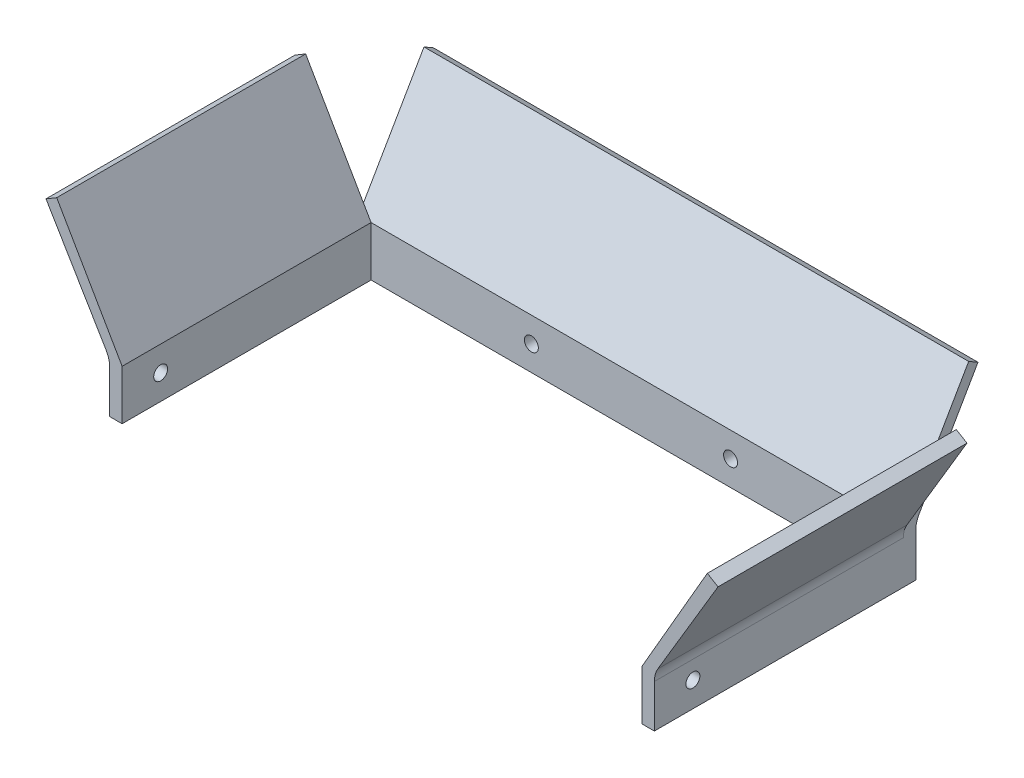
ISO-10303-21;
HEADER;
FILE_DESCRIPTION(('STEP AP214'),'2;1');
FILE_NAME('part.step','',(''),(''),'','','');
FILE_SCHEMA(('AUTOMOTIVE_DESIGN { 1 0 10303 214 1 1 1 1 }'));
ENDSEC;
DATA;
#1=APPLICATION_CONTEXT('core data for automotive mechanical design processes');
#2=APPLICATION_PROTOCOL_DEFINITION('international standard','automotive_design',2000,#1);
#3=PRODUCT_CONTEXT('',#1,'mechanical');
#4=PRODUCT('Part','Part','',(#3));
#5=PRODUCT_RELATED_PRODUCT_CATEGORY('part','',(#4));
#6=PRODUCT_DEFINITION_FORMATION('','',#4);
#7=PRODUCT_DEFINITION_CONTEXT('part definition',#1,'design');
#8=PRODUCT_DEFINITION('design','',#6,#7);
#9=PRODUCT_DEFINITION_SHAPE('','',#8);
#10=(LENGTH_UNIT() NAMED_UNIT(*) SI_UNIT(.MILLI.,.METRE.));
#11=(NAMED_UNIT(*) PLANE_ANGLE_UNIT() SI_UNIT($,.RADIAN.));
#12=(NAMED_UNIT(*) SI_UNIT($,.STERADIAN.) SOLID_ANGLE_UNIT());
#13=UNCERTAINTY_MEASURE_WITH_UNIT(LENGTH_MEASURE(1.E-05),#10,'distance_accuracy_value','');
#14=(GEOMETRIC_REPRESENTATION_CONTEXT(3) GLOBAL_UNCERTAINTY_ASSIGNED_CONTEXT((#13)) GLOBAL_UNIT_ASSIGNED_CONTEXT((#10,
#11,#12)) REPRESENTATION_CONTEXT('',''));
#15=CARTESIAN_POINT('',(0.,0.,0.));
#16=DIRECTION('',(0.,0.,1.));
#17=DIRECTION('',(1.,0.,0.));
#18=AXIS2_PLACEMENT_3D('',#15,#16,#17);
#19=CARTESIAN_POINT('',(0.,0.,3.175));
#20=DIRECTION('',(0.,0.,-1.));
#21=DIRECTION('',(-1.,0.,0.));
#22=AXIS2_PLACEMENT_3D('',#19,#20,#21);
#23=PLANE('',#22);
#24=CARTESIAN_POINT('',(-94.86280494,-6.35000000000001,3.175));
#25=DIRECTION('',(0.,0.,1.));
#26=DIRECTION('',(1.,0.,0.));
#27=AXIS2_PLACEMENT_3D('',#24,#25,#26);
#28=CIRCLE('',#27,1.77800000000001);
#29=CARTESIAN_POINT('',(-93.08480494,-6.35000000000001,3.175));
#30=VERTEX_POINT('',#29);
#31=EDGE_CURVE('E286',#30,#30,#28,.T.);
#32=ORIENTED_EDGE('',*,*,#31,.F.);
#33=EDGE_LOOP('',(#32));
#34=FACE_BOUND('',#33,.T.);
#35=CARTESIAN_POINT('',(-44.06280494,-6.35,3.175));
#36=DIRECTION('',(0.,0.,1.));
#37=DIRECTION('',(1.,0.,0.));
#38=AXIS2_PLACEMENT_3D('',#35,#36,#37);
#39=CIRCLE('',#38,1.77800000000001);
#40=CARTESIAN_POINT('',(-42.28480494,-6.35,3.175));
#41=VERTEX_POINT('',#40);
#42=EDGE_CURVE('E280',#41,#41,#39,.T.);
#43=ORIENTED_EDGE('',*,*,#42,.F.);
#44=EDGE_LOOP('',(#43));
#45=FACE_BOUND('',#44,.T.);
#46=DIRECTION('',(0.,-1.,0.));
#47=VECTOR('',#46,1.);
#48=CARTESIAN_POINT('',(-3.175,0.,3.175));
#49=LINE('',#48,#47);
#50=CARTESIAN_POINT('',(-3.175,0.,3.175));
#51=VERTEX_POINT('',#50);
#52=CARTESIAN_POINT('',(-3.175,-12.7,3.175));
#53=VERTEX_POINT('',#52);
#54=EDGE_CURVE('E248',#51,#53,#49,.T.);
#55=ORIENTED_EDGE('',*,*,#54,.F.);
#56=DIRECTION('',(-1.,0.,0.));
#57=VECTOR('',#56,1.);
#58=CARTESIAN_POINT('',(0.,0.,3.175));
#59=LINE('',#58,#57);
#60=CARTESIAN_POINT('',(-135.75060988,0.,3.175));
#61=VERTEX_POINT('',#60);
#62=EDGE_CURVE('E292',#51,#61,#59,.T.);
#63=ORIENTED_EDGE('',*,*,#62,.T.);
#64=DIRECTION('',(0.,1.,0.));
#65=VECTOR('',#64,1.);
#66=CARTESIAN_POINT('',(-135.75060988,0.,3.175));
#67=LINE('',#66,#65);
#68=CARTESIAN_POINT('',(-135.75060988,-12.7,3.175));
#69=VERTEX_POINT('',#68);
#70=EDGE_CURVE('E265',#69,#61,#67,.T.);
#71=ORIENTED_EDGE('',*,*,#70,.F.);
#72=DIRECTION('',(1.,0.,0.));
#73=VECTOR('',#72,1.);
#74=CARTESIAN_POINT('',(0.,-12.7,3.175));
#75=LINE('',#74,#73);
#76=EDGE_CURVE('E294',#69,#53,#75,.T.);
#77=ORIENTED_EDGE('',*,*,#76,.T.);
#78=EDGE_LOOP('',(#55,#63,#71,#77));
#79=FACE_BOUND('',#78,.T.);
#80=ADVANCED_FACE('F33',(#34,#45,#79),#23,.F.);
#81=CARTESIAN_POINT('',(0.,0.,0.));
#82=DIRECTION('',(0.,0.,-1.));
#83=DIRECTION('',(-1.,0.,0.));
#84=AXIS2_PLACEMENT_3D('',#81,#82,#83);
#85=PLANE('',#84);
#86=CARTESIAN_POINT('',(-94.86280494,-6.35000000000001,0.));
#87=DIRECTION('',(0.,0.,1.));
#88=DIRECTION('',(1.,0.,0.));
#89=AXIS2_PLACEMENT_3D('',#86,#87,#88);
#90=CIRCLE('',#89,1.77800000000001);
#91=CARTESIAN_POINT('',(-93.08480494,-6.35000000000001,0.));
#92=VERTEX_POINT('',#91);
#93=EDGE_CURVE('E283',#92,#92,#90,.T.);
#94=ORIENTED_EDGE('',*,*,#93,.T.);
#95=EDGE_LOOP('',(#94));
#96=FACE_BOUND('',#95,.T.);
#97=DIRECTION('',(0.,-1.,0.));
#98=VECTOR('',#97,1.);
#99=CARTESIAN_POINT('',(-138.92560988,0.,0.));
#100=LINE('',#99,#98);
#101=CARTESIAN_POINT('',(-138.92560988,-1.70147737193766,0.));
#102=VERTEX_POINT('',#101);
#103=CARTESIAN_POINT('',(-138.92560988,-12.7,0.));
#104=VERTEX_POINT('',#103);
#105=EDGE_CURVE('E300',#102,#104,#100,.T.);
#106=ORIENTED_EDGE('',*,*,#105,.F.);
#107=DIRECTION('',(-1.,0.,0.));
#108=VECTOR('',#107,1.);
#109=CARTESIAN_POINT('',(0.,-1.70147737193765,0.));
#110=LINE('',#109,#108);
#111=CARTESIAN_POINT('',(0.,-1.70147737193765,0.));
#112=VERTEX_POINT('',#111);
#113=EDGE_CURVE('E320',#102,#112,#110,.F.);
#114=ORIENTED_EDGE('',*,*,#113,.T.);
#115=DIRECTION('',(0.,1.,0.));
#116=VECTOR('',#115,1.);
#117=CARTESIAN_POINT('',(0.,0.,0.));
#118=LINE('',#117,#116);
#119=CARTESIAN_POINT('',(0.,-12.7,0.));
#120=VERTEX_POINT('',#119);
#121=EDGE_CURVE('E289',#120,#112,#118,.T.);
#122=ORIENTED_EDGE('',*,*,#121,.F.);
#123=DIRECTION('',(1.,0.,0.));
#124=VECTOR('',#123,1.);
#125=CARTESIAN_POINT('',(0.,-12.7,0.));
#126=LINE('',#125,#124);
#127=EDGE_CURVE('E295',#104,#120,#126,.T.);
#128=ORIENTED_EDGE('',*,*,#127,.F.);
#129=EDGE_LOOP('',(#106,#114,#122,#128));
#130=FACE_BOUND('',#129,.T.);
#131=CARTESIAN_POINT('',(-44.06280494,-6.35,0.));
#132=DIRECTION('',(0.,0.,1.));
#133=DIRECTION('',(1.,0.,0.));
#134=AXIS2_PLACEMENT_3D('',#131,#132,#133);
#135=CIRCLE('',#134,1.77800000000001);
#136=CARTESIAN_POINT('',(-42.28480494,-6.35,0.));
#137=VERTEX_POINT('',#136);
#138=EDGE_CURVE('E279',#137,#137,#135,.T.);
#139=ORIENTED_EDGE('',*,*,#138,.T.);
#140=EDGE_LOOP('',(#139));
#141=FACE_BOUND('',#140,.T.);
#142=ADVANCED_FACE('F356',(#96,#130,#141),#85,.T.);
#143=CARTESIAN_POINT('',(0.,0.,3.175));
#144=DIRECTION('',(-1.,0.,0.));
#145=DIRECTION('',(0.,-1.,0.));
#146=AXIS2_PLACEMENT_3D('',#143,#144,#145);
#147=PLANE('',#146);
#148=CARTESIAN_POINT('',(0.,-6.35,56.840236332));
#149=DIRECTION('',(1.,0.,0.));
#150=DIRECTION('',(0.,1.,0.));
#151=AXIS2_PLACEMENT_3D('',#148,#149,#150);
#152=CIRCLE('',#151,1.778);
#153=CARTESIAN_POINT('',(0.,-4.572,56.840236332));
#154=VERTEX_POINT('',#153);
#155=EDGE_CURVE('E238',#154,#154,#152,.T.);
#156=ORIENTED_EDGE('',*,*,#155,.F.);
#157=EDGE_LOOP('',(#156));
#158=FACE_BOUND('',#157,.T.);
#159=DIRECTION('',(0.,-0.86602540378444,0.499999999999998));
#160=VECTOR('',#159,1.);
#161=CARTESIAN_POINT('',(0.,0.,3.175));
#162=LINE('',#161,#160);
#163=CARTESIAN_POINT('',(0.,28.8711218986638,-13.4937499999999));
#164=VERTEX_POINT('',#163);
#165=CARTESIAN_POINT('',(0.,0.,3.175));
#166=VERTEX_POINT('',#165);
#167=EDGE_CURVE('E226',#164,#166,#162,.T.);
#168=ORIENTED_EDGE('',*,*,#167,.T.);
#169=DIRECTION('',(0.,-1.,0.));
#170=VECTOR('',#169,1.);
#171=CARTESIAN_POINT('',(0.,0.,3.175));
#172=LINE('',#171,#170);
#173=CARTESIAN_POINT('',(0.,-1.74712173874334,3.175));
#174=VERTEX_POINT('',#173);
#175=EDGE_CURVE('E48',#166,#174,#172,.T.);
#176=ORIENTED_EDGE('',*,*,#175,.T.);
#177=DIRECTION('',(0.,0.,-1.));
#178=VECTOR('',#177,1.);
#179=CARTESIAN_POINT('',(0.,-1.74712173874334,3.175));
#180=LINE('',#179,#178);
#181=CARTESIAN_POINT('',(0.,-1.74712173874334,66.675));
#182=VERTEX_POINT('',#181);
#183=EDGE_CURVE('E325',#174,#182,#180,.F.);
#184=ORIENTED_EDGE('',*,*,#183,.T.);
#185=DIRECTION('',(0.,1.,0.));
#186=VECTOR('',#185,1.);
#187=CARTESIAN_POINT('',(0.,0.,66.675));
#188=LINE('',#187,#186);
#189=CARTESIAN_POINT('',(0.,-12.7,66.675));
#190=VERTEX_POINT('',#189);
#191=EDGE_CURVE('E249',#190,#182,#188,.T.);
#192=ORIENTED_EDGE('',*,*,#191,.F.);
#193=DIRECTION('',(0.,0.,-1.));
#194=VECTOR('',#193,1.);
#195=CARTESIAN_POINT('',(0.,-12.7,3.175));
#196=LINE('',#195,#194);
#197=EDGE_CURVE('E297',#190,#120,#196,.T.);
#198=ORIENTED_EDGE('',*,*,#197,.T.);
#199=ORIENTED_EDGE('',*,*,#121,.T.);
#200=CARTESIAN_POINT('',(0.,-1.70147737193765,-6.35));
#201=DIRECTION('',(-1.,0.,0.));
#202=DIRECTION('',(0.,-1.,0.));
#203=AXIS2_PLACEMENT_3D('',#200,#201,#202);
#204=CIRCLE('',#203,6.35);
#205=CARTESIAN_POINT('',(0.,1.47352262806239,-0.850738685968832));
#206=VERTEX_POINT('',#205);
#207=EDGE_CURVE('E334',#112,#206,#204,.T.);
#208=ORIENTED_EDGE('',*,*,#207,.T.);
#209=DIRECTION('',(0.,0.866025403784436,-0.500000000000004));
#210=VECTOR('',#209,1.);
#211=CARTESIAN_POINT('',(0.,27.4963065701559,-15.8750000000001));
#212=LINE('',#211,#210);
#213=CARTESIAN_POINT('',(0.,27.4963065701559,-15.8750000000001));
#214=VERTEX_POINT('',#213);
#215=EDGE_CURVE('E208',#206,#214,#212,.T.);
#216=ORIENTED_EDGE('',*,*,#215,.T.);
#217=DIRECTION('',(0.,0.500000000000004,0.866025403784436));
#218=VECTOR('',#217,1.);
#219=CARTESIAN_POINT('',(0.,28.8711218986638,-13.4937499999999));
#220=LINE('',#219,#218);
#221=EDGE_CURVE('E223',#214,#164,#220,.T.);
#222=ORIENTED_EDGE('',*,*,#221,.T.);
#223=EDGE_LOOP('',(#168,#176,#184,#192,#198,#199,#208,#216,#222));
#224=FACE_BOUND('',#223,.T.);
#225=ADVANCED_FACE('F338',(#158,#224),#147,.F.);
#226=CARTESIAN_POINT('',(-138.92560988,0.,3.175));
#227=DIRECTION('',(1.,0.,0.));
#228=DIRECTION('',(0.,0.,-1.));
#229=AXIS2_PLACEMENT_3D('',#226,#227,#228);
#230=PLANE('',#229);
#231=CARTESIAN_POINT('',(-138.92560988,-6.35000000000002,56.840236332));
#232=DIRECTION('',(1.,0.,0.));
#233=DIRECTION('',(0.,0.,-1.));
#234=AXIS2_PLACEMENT_3D('',#231,#232,#233);
#235=CIRCLE('',#234,1.778);
#236=CARTESIAN_POINT('',(-138.92560988,-4.57200000000002,56.840236332));
#237=VERTEX_POINT('',#236);
#238=EDGE_CURVE('E245',#237,#237,#235,.T.);
#239=ORIENTED_EDGE('',*,*,#238,.T.);
#240=EDGE_LOOP('',(#239));
#241=FACE_BOUND('',#240,.T.);
#242=DIRECTION('',(0.,-1.,0.));
#243=VECTOR('',#242,1.);
#244=CARTESIAN_POINT('',(-138.92560988,0.,66.675));
#245=LINE('',#244,#243);
#246=CARTESIAN_POINT('',(-138.92560988,-1.74712173874333,66.675));
#247=VERTEX_POINT('',#246);
#248=CARTESIAN_POINT('',(-138.92560988,-12.7,66.675));
#249=VERTEX_POINT('',#248);
#250=EDGE_CURVE('E266',#247,#249,#245,.T.);
#251=ORIENTED_EDGE('',*,*,#250,.F.);
#252=DIRECTION('',(0.,0.,-1.));
#253=VECTOR('',#252,1.);
#254=CARTESIAN_POINT('',(-138.92560988,-1.74712173874333,3.175));
#255=LINE('',#254,#253);
#256=CARTESIAN_POINT('',(-138.92560988,-1.74712173874333,3.175));
#257=VERTEX_POINT('',#256);
#258=EDGE_CURVE('E312',#247,#257,#255,.T.);
#259=ORIENTED_EDGE('',*,*,#258,.T.);
#260=DIRECTION('',(0.,1.,0.));
#261=VECTOR('',#260,1.);
#262=CARTESIAN_POINT('',(-138.92560988,0.,3.175));
#263=LINE('',#262,#261);
#264=CARTESIAN_POINT('',(-138.92560988,0.,3.175));
#265=VERTEX_POINT('',#264);
#266=EDGE_CURVE('E310',#257,#265,#263,.T.);
#267=ORIENTED_EDGE('',*,*,#266,.T.);
#268=DIRECTION('',(0.,0.86602540378444,-0.499999999999998));
#269=VECTOR('',#268,1.);
#270=CARTESIAN_POINT('',(-138.92560988,0.,3.175));
#271=LINE('',#270,#269);
#272=CARTESIAN_POINT('',(-138.92560988,28.8711218986638,-13.4937499999999));
#273=VERTEX_POINT('',#272);
#274=EDGE_CURVE('E218',#265,#273,#271,.T.);
#275=ORIENTED_EDGE('',*,*,#274,.T.);
#276=DIRECTION('',(0.,-0.500000000000004,-0.866025403784436));
#277=VECTOR('',#276,1.);
#278=CARTESIAN_POINT('',(-138.92560988,28.8711218986638,-13.4937499999999));
#279=LINE('',#278,#277);
#280=CARTESIAN_POINT('',(-138.92560988,27.4963065701558,-15.8750000000001));
#281=VERTEX_POINT('',#280);
#282=EDGE_CURVE('E216',#273,#281,#279,.T.);
#283=ORIENTED_EDGE('',*,*,#282,.T.);
#284=DIRECTION('',(0.,-0.866025403784436,0.500000000000004));
#285=VECTOR('',#284,1.);
#286=CARTESIAN_POINT('',(-138.92560988,27.4963065701558,-15.8750000000001));
#287=LINE('',#286,#285);
#288=CARTESIAN_POINT('',(-138.92560988,1.47352262806236,-0.850738685968829));
#289=VERTEX_POINT('',#288);
#290=EDGE_CURVE('E221',#281,#289,#287,.T.);
#291=ORIENTED_EDGE('',*,*,#290,.T.);
#292=CARTESIAN_POINT('',(-138.92560988,-1.70147737193766,-6.35));
#293=DIRECTION('',(1.,0.,0.));
#294=DIRECTION('',(0.,0.,-1.));
#295=AXIS2_PLACEMENT_3D('',#292,#293,#294);
#296=CIRCLE('',#295,6.35);
#297=EDGE_CURVE('E332',#289,#102,#296,.T.);
#298=ORIENTED_EDGE('',*,*,#297,.T.);
#299=ORIENTED_EDGE('',*,*,#105,.T.);
#300=DIRECTION('',(0.,0.,-1.));
#301=VECTOR('',#300,1.);
#302=CARTESIAN_POINT('',(-138.92560988,-12.7,3.175));
#303=LINE('',#302,#301);
#304=EDGE_CURVE('E305',#249,#104,#303,.T.);
#305=ORIENTED_EDGE('',*,*,#304,.F.);
#306=EDGE_LOOP('',(#251,#259,#267,#275,#283,#291,#298,#299,#305));
#307=FACE_BOUND('',#306,.T.);
#308=ADVANCED_FACE('F352',(#241,#307),#230,.F.);
#309=CARTESIAN_POINT('',(0.,-12.7,3.175));
#310=DIRECTION('',(0.,1.,0.));
#311=DIRECTION('',(-1.,0.,0.));
#312=AXIS2_PLACEMENT_3D('',#309,#310,#311);
#313=PLANE('',#312);
#314=ORIENTED_EDGE('',*,*,#127,.T.);
#315=ORIENTED_EDGE('',*,*,#197,.F.);
#316=DIRECTION('',(1.,0.,0.));
#317=VECTOR('',#316,1.);
#318=CARTESIAN_POINT('',(0.,-12.7,66.675));
#319=LINE('',#318,#317);
#320=CARTESIAN_POINT('',(-3.175,-12.7,66.675));
#321=VERTEX_POINT('',#320);
#322=EDGE_CURVE('E254',#321,#190,#319,.T.);
#323=ORIENTED_EDGE('',*,*,#322,.F.);
#324=DIRECTION('',(0.,0.,-1.));
#325=VECTOR('',#324,1.);
#326=CARTESIAN_POINT('',(-3.175,-12.7,66.675));
#327=LINE('',#326,#325);
#328=EDGE_CURVE('E257',#321,#53,#327,.T.);
#329=ORIENTED_EDGE('',*,*,#328,.T.);
#330=ORIENTED_EDGE('',*,*,#76,.F.);
#331=DIRECTION('',(0.,0.,-1.));
#332=VECTOR('',#331,1.);
#333=CARTESIAN_POINT('',(-135.75060988,-12.7,66.675));
#334=LINE('',#333,#332);
#335=CARTESIAN_POINT('',(-135.75060988,-12.7,66.675));
#336=VERTEX_POINT('',#335);
#337=EDGE_CURVE('E276',#336,#69,#334,.T.);
#338=ORIENTED_EDGE('',*,*,#337,.F.);
#339=DIRECTION('',(1.,0.,0.));
#340=VECTOR('',#339,1.);
#341=CARTESIAN_POINT('',(-138.92560988,-12.7,66.675));
#342=LINE('',#341,#340);
#343=EDGE_CURVE('E268',#249,#336,#342,.T.);
#344=ORIENTED_EDGE('',*,*,#343,.F.);
#345=ORIENTED_EDGE('',*,*,#304,.T.);
#346=EDGE_LOOP('',(#314,#315,#323,#329,#330,#338,#344,#345));
#347=FACE_BOUND('',#346,.T.);
#348=ADVANCED_FACE('F359',(#347),#313,.F.);
#349=CARTESIAN_POINT('',(-94.86280494,-6.35000000000001,3.175));
#350=DIRECTION('',(0.,0.,-1.));
#351=DIRECTION('',(-1.,0.,0.));
#352=AXIS2_PLACEMENT_3D('',#349,#350,#351);
#353=CYLINDRICAL_SURFACE('',#352,1.77800000000001);
#354=ORIENTED_EDGE('',*,*,#31,.T.);
#355=EDGE_LOOP('',(#354));
#356=FACE_BOUND('',#355,.T.);
#357=ORIENTED_EDGE('',*,*,#93,.F.);
#358=EDGE_LOOP('',(#357));
#359=FACE_BOUND('',#358,.T.);
#360=ADVANCED_FACE('F433',(#356,#359),#353,.F.);
#361=CARTESIAN_POINT('',(-44.06280494,-6.35,3.175));
#362=DIRECTION('',(0.,0.,-1.));
#363=DIRECTION('',(-1.,0.,0.));
#364=AXIS2_PLACEMENT_3D('',#361,#362,#363);
#365=CYLINDRICAL_SURFACE('',#364,1.77800000000001);
#366=ORIENTED_EDGE('',*,*,#42,.T.);
#367=EDGE_LOOP('',(#366));
#368=FACE_BOUND('',#367,.T.);
#369=ORIENTED_EDGE('',*,*,#138,.F.);
#370=EDGE_LOOP('',(#369));
#371=FACE_BOUND('',#370,.T.);
#372=ADVANCED_FACE('F569',(#368,#371),#365,.F.);
#373=CARTESIAN_POINT('',(-135.75060988,0.,66.675));
#374=DIRECTION('',(-1.,0.,0.));
#375=DIRECTION('',(0.,0.,1.));
#376=AXIS2_PLACEMENT_3D('',#373,#374,#375);
#377=PLANE('',#376);
#378=CARTESIAN_POINT('',(-135.75060988,-6.35000000000002,56.840236332));
#379=DIRECTION('',(-1.,0.,0.));
#380=DIRECTION('',(0.,0.,1.));
#381=AXIS2_PLACEMENT_3D('',#378,#379,#380);
#382=CIRCLE('',#381,1.778);
#383=CARTESIAN_POINT('',(-135.75060988,-4.57200000000002,56.840236332));
#384=VERTEX_POINT('',#383);
#385=EDGE_CURVE('E242',#384,#384,#382,.T.);
#386=ORIENTED_EDGE('',*,*,#385,.T.);
#387=EDGE_LOOP('',(#386));
#388=FACE_BOUND('',#387,.T.);
#389=ORIENTED_EDGE('',*,*,#70,.T.);
#390=DIRECTION('',(0.,0.,-1.));
#391=VECTOR('',#390,1.);
#392=CARTESIAN_POINT('',(-135.75060988,0.,66.675));
#393=LINE('',#392,#391);
#394=CARTESIAN_POINT('',(-135.75060988,0.,66.675));
#395=VERTEX_POINT('',#394);
#396=EDGE_CURVE('E183',#395,#61,#393,.T.);
#397=ORIENTED_EDGE('',*,*,#396,.F.);
#398=DIRECTION('',(0.,1.,0.));
#399=VECTOR('',#398,1.);
#400=CARTESIAN_POINT('',(-135.75060988,0.,66.675));
#401=LINE('',#400,#399);
#402=EDGE_CURVE('E270',#336,#395,#401,.T.);
#403=ORIENTED_EDGE('',*,*,#402,.F.);
#404=ORIENTED_EDGE('',*,*,#337,.T.);
#405=EDGE_LOOP('',(#389,#397,#403,#404));
#406=FACE_BOUND('',#405,.T.);
#407=ADVANCED_FACE('F396',(#388,#406),#377,.F.);
#408=CARTESIAN_POINT('',(0.,0.,66.675));
#409=DIRECTION('',(0.,0.,1.));
#410=DIRECTION('',(1.,0.,0.));
#411=AXIS2_PLACEMENT_3D('',#408,#409,#410);
#412=PLANE('',#411);
#413=DIRECTION('',(0.511549963229276,-0.859253533667523,0.));
#414=VECTOR('',#413,1.);
#415=CARTESIAN_POINT('',(-138.92560988,0.,66.675));
#416=LINE('',#415,#414);
#417=CARTESIAN_POINT('',(-155.16732121253,27.2812996939439,66.675));
#418=VERTEX_POINT('',#417);
#419=CARTESIAN_POINT('',(-139.819349941211,1.50122052776257,66.675));
#420=VERTEX_POINT('',#419);
#421=EDGE_CURVE('E184',#418,#420,#416,.T.);
#422=ORIENTED_EDGE('',*,*,#421,.T.);
#423=CARTESIAN_POINT('',(-145.27560988,-1.74712173874333,66.675));
#424=DIRECTION('',(0.,0.,1.));
#425=DIRECTION('',(1.,0.,0.));
#426=AXIS2_PLACEMENT_3D('',#423,#424,#425);
#427=CIRCLE('',#426,6.35);
#428=EDGE_CURVE('E330',#420,#247,#427,.F.);
#429=ORIENTED_EDGE('',*,*,#428,.T.);
#430=ORIENTED_EDGE('',*,*,#250,.T.);
#431=ORIENTED_EDGE('',*,*,#343,.T.);
#432=ORIENTED_EDGE('',*,*,#402,.T.);
#433=DIRECTION('',(-0.500000000000004,0.866025403784436,0.));
#434=VECTOR('',#433,1.);
#435=CARTESIAN_POINT('',(-152.439191243135,28.9054708271968,66.675));
#436=LINE('',#435,#434);
#437=CARTESIAN_POINT('',(-152.439191243135,28.9054708271968,66.675));
#438=VERTEX_POINT('',#437);
#439=EDGE_CURVE('E190',#395,#438,#436,.T.);
#440=ORIENTED_EDGE('',*,*,#439,.T.);
#441=DIRECTION('',(-0.859253533667526,-0.511549963229273,0.));
#442=VECTOR('',#441,1.);
#443=CARTESIAN_POINT('',(-155.16732121253,27.2812996939439,66.675));
#444=LINE('',#443,#442);
#445=EDGE_CURVE('E177',#438,#418,#444,.T.);
#446=ORIENTED_EDGE('',*,*,#445,.T.);
#447=EDGE_LOOP('',(#422,#429,#430,#431,#432,#440,#446));
#448=FACE_BOUND('',#447,.T.);
#449=ADVANCED_FACE('F400',(#448),#412,.T.);
#450=CARTESIAN_POINT('',(-3.175,0.,66.675));
#451=DIRECTION('',(1.,0.,0.));
#452=DIRECTION('',(0.,1.,0.));
#453=AXIS2_PLACEMENT_3D('',#450,#451,#452);
#454=PLANE('',#453);
#455=CARTESIAN_POINT('',(-3.17500000000001,-6.35,56.840236332));
#456=DIRECTION('',(1.,0.,0.));
#457=DIRECTION('',(0.,1.,0.));
#458=AXIS2_PLACEMENT_3D('',#455,#456,#457);
#459=CIRCLE('',#458,1.778);
#460=CARTESIAN_POINT('',(-3.17500000000004,-4.572,56.840236332));
#461=VERTEX_POINT('',#460);
#462=EDGE_CURVE('E241',#461,#461,#459,.T.);
#463=ORIENTED_EDGE('',*,*,#462,.T.);
#464=EDGE_LOOP('',(#463));
#465=FACE_BOUND('',#464,.T.);
#466=ORIENTED_EDGE('',*,*,#54,.T.);
#467=ORIENTED_EDGE('',*,*,#328,.F.);
#468=DIRECTION('',(0.,-1.,0.));
#469=VECTOR('',#468,1.);
#470=CARTESIAN_POINT('',(-3.175,0.,66.675));
#471=LINE('',#470,#469);
#472=CARTESIAN_POINT('',(-3.175,0.,66.675));
#473=VERTEX_POINT('',#472);
#474=EDGE_CURVE('E252',#473,#321,#471,.T.);
#475=ORIENTED_EDGE('',*,*,#474,.F.);
#476=DIRECTION('',(0.,0.,-1.));
#477=VECTOR('',#476,1.);
#478=CARTESIAN_POINT('',(-3.175,0.,66.675));
#479=LINE('',#478,#477);
#480=EDGE_CURVE('E262',#473,#51,#479,.T.);
#481=ORIENTED_EDGE('',*,*,#480,.T.);
#482=EDGE_LOOP('',(#466,#467,#475,#481));
#483=FACE_BOUND('',#482,.T.);
#484=ADVANCED_FACE('F386',(#465,#483),#454,.F.);
#485=CARTESIAN_POINT('',(0.,0.,66.675));
#486=DIRECTION('',(0.,0.,-1.));
#487=DIRECTION('',(-1.,0.,0.));
#488=AXIS2_PLACEMENT_3D('',#485,#486,#487);
#489=PLANE('',#488);
#490=ORIENTED_EDGE('',*,*,#191,.T.);
#491=CARTESIAN_POINT('',(6.35,-1.74712173874334,66.675));
#492=DIRECTION('',(0.,0.,-1.));
#493=DIRECTION('',(-1.,0.,0.));
#494=AXIS2_PLACEMENT_3D('',#491,#492,#493);
#495=CIRCLE('',#494,6.35);
#496=CARTESIAN_POINT('',(0.893740061211224,1.50122052776256,66.675));
#497=VERTEX_POINT('',#496);
#498=EDGE_CURVE('E11',#182,#497,#495,.T.);
#499=ORIENTED_EDGE('',*,*,#498,.T.);
#500=DIRECTION('',(0.511549963229276,0.859253533667524,0.));
#501=VECTOR('',#500,1.);
#502=CARTESIAN_POINT('',(16.2417113325295,27.2812996939439,66.675));
#503=LINE('',#502,#501);
#504=CARTESIAN_POINT('',(16.2417113325295,27.2812996939439,66.675));
#505=VERTEX_POINT('',#504);
#506=EDGE_CURVE('E192',#497,#505,#503,.T.);
#507=ORIENTED_EDGE('',*,*,#506,.T.);
#508=DIRECTION('',(-0.859253533667524,0.511549963229276,0.));
#509=VECTOR('',#508,1.);
#510=CARTESIAN_POINT('',(13.5135813631351,28.9054708271968,66.675));
#511=LINE('',#510,#509);
#512=CARTESIAN_POINT('',(13.5135813631351,28.9054708271968,66.675));
#513=VERTEX_POINT('',#512);
#514=EDGE_CURVE('E199',#505,#513,#511,.T.);
#515=ORIENTED_EDGE('',*,*,#514,.T.);
#516=DIRECTION('',(-0.500000000000004,-0.866025403784436,0.));
#517=VECTOR('',#516,1.);
#518=CARTESIAN_POINT('',(-3.175,0.,66.675));
#519=LINE('',#518,#517);
#520=EDGE_CURVE('E195',#513,#473,#519,.T.);
#521=ORIENTED_EDGE('',*,*,#520,.T.);
#522=ORIENTED_EDGE('',*,*,#474,.T.);
#523=ORIENTED_EDGE('',*,*,#322,.T.);
#524=EDGE_LOOP('',(#490,#499,#507,#515,#521,#522,#523));
#525=FACE_BOUND('',#524,.T.);
#526=ADVANCED_FACE('F366',(#525),#489,.F.);
#527=CARTESIAN_POINT('',(-152.4,-6.35000000000002,56.840236332));
#528=DIRECTION('',(1.,0.,0.));
#529=DIRECTION('',(0.,1.,0.));
#530=AXIS2_PLACEMENT_3D('',#527,#528,#529);
#531=CYLINDRICAL_SURFACE('',#530,1.778);
#532=CARTESIAN_POINT('',(0.,-4.572,56.840236332));
#533=CARTESIAN_POINT('',(-0.0330729166666636,-4.572,56.840236332));
#534=CARTESIAN_POINT('',(-0.0661458333333272,-4.572,56.840236332));
#535=CARTESIAN_POINT('',(-0.132291666666664,-4.572,56.840236332));
#536=CARTESIAN_POINT('',(-0.165364583333337,-4.572,56.840236332));
#537=CARTESIAN_POINT('',(-0.231510416666673,-4.572,56.840236332));
#538=CARTESIAN_POINT('',(-0.264583333333337,-4.572,56.840236332));
#539=CARTESIAN_POINT('',(-0.330729166666673,-4.572,56.840236332));
#540=CARTESIAN_POINT('',(-0.363802083333346,-4.572,56.840236332));
#541=CARTESIAN_POINT('',(-0.429947916666682,-4.572,56.840236332));
#542=CARTESIAN_POINT('',(-0.463020833333346,-4.572,56.840236332));
#543=CARTESIAN_POINT('',(-0.529166666666673,-4.572,56.840236332));
#544=CARTESIAN_POINT('',(-0.562239583333337,-4.572,56.840236332));
#545=CARTESIAN_POINT('',(-0.628385416666673,-4.572,56.840236332));
#546=CARTESIAN_POINT('',(-0.661458333333346,-4.572,56.840236332));
#547=CARTESIAN_POINT('',(-0.727604166666682,-4.572,56.840236332));
#548=CARTESIAN_POINT('',(-0.760677083333346,-4.572,56.840236332));
#549=CARTESIAN_POINT('',(-0.826822916666673,-4.572,56.840236332));
#550=CARTESIAN_POINT('',(-0.859895833333337,-4.572,56.840236332));
#551=CARTESIAN_POINT('',(-0.926041666666673,-4.572,56.840236332));
#552=CARTESIAN_POINT('',(-0.959114583333346,-4.572,56.840236332));
#553=CARTESIAN_POINT('',(-1.02526041666668,-4.572,56.840236332));
#554=CARTESIAN_POINT('',(-1.05833333333335,-4.572,56.840236332));
#555=CARTESIAN_POINT('',(-1.12447916666667,-4.572,56.840236332));
#556=CARTESIAN_POINT('',(-1.15755208333334,-4.572,56.840236332));
#557=CARTESIAN_POINT('',(-1.22369791666667,-4.572,56.840236332));
#558=CARTESIAN_POINT('',(-1.25677083333335,-4.572,56.840236332));
#559=CARTESIAN_POINT('',(-1.32291666666668,-4.572,56.840236332));
#560=CARTESIAN_POINT('',(-1.35598958333335,-4.572,56.840236332));
#561=CARTESIAN_POINT('',(-1.42213541666668,-4.572,56.840236332));
#562=CARTESIAN_POINT('',(-1.45520833333336,-4.572,56.840236332));
#563=CARTESIAN_POINT('',(-1.52135416666669,-4.572,56.840236332));
#564=CARTESIAN_POINT('',(-1.55442708333336,-4.572,56.840236332));
#565=CARTESIAN_POINT('',(-1.62057291666668,-4.572,56.840236332));
#566=CARTESIAN_POINT('',(-1.65364583333335,-4.572,56.840236332));
#567=CARTESIAN_POINT('',(-1.71979166666668,-4.572,56.840236332));
#568=CARTESIAN_POINT('',(-1.75286458333336,-4.572,56.840236332));
#569=CARTESIAN_POINT('',(-1.81901041666669,-4.572,56.840236332));
#570=CARTESIAN_POINT('',(-1.85208333333336,-4.572,56.840236332));
#571=CARTESIAN_POINT('',(-1.91822916666669,-4.572,56.840236332));
#572=CARTESIAN_POINT('',(-1.95130208333337,-4.572,56.840236332));
#573=CARTESIAN_POINT('',(-2.0174479166667,-4.572,56.840236332));
#574=CARTESIAN_POINT('',(-2.05052083333337,-4.572,56.840236332));
#575=CARTESIAN_POINT('',(-2.11666666666669,-4.572,56.840236332));
#576=CARTESIAN_POINT('',(-2.14973958333336,-4.572,56.840236332));
#577=CARTESIAN_POINT('',(-2.21588541666669,-4.572,56.840236332));
#578=CARTESIAN_POINT('',(-2.24895833333337,-4.572,56.840236332));
#579=CARTESIAN_POINT('',(-2.3151041666667,-4.572,56.840236332));
#580=CARTESIAN_POINT('',(-2.34817708333337,-4.572,56.840236332));
#581=CARTESIAN_POINT('',(-2.41432291666669,-4.572,56.840236332));
#582=CARTESIAN_POINT('',(-2.44739583333336,-4.572,56.840236332));
#583=CARTESIAN_POINT('',(-2.51354166666669,-4.572,56.840236332));
#584=CARTESIAN_POINT('',(-2.54661458333337,-4.572,56.840236332));
#585=CARTESIAN_POINT('',(-2.6127604166667,-4.572,56.840236332));
#586=CARTESIAN_POINT('',(-2.64583333333337,-4.572,56.840236332));
#587=CARTESIAN_POINT('',(-2.71197916666669,-4.572,56.840236332));
#588=CARTESIAN_POINT('',(-2.74505208333336,-4.572,56.840236332));
#589=CARTESIAN_POINT('',(-2.81119791666669,-4.572,56.840236332));
#590=CARTESIAN_POINT('',(-2.84427083333337,-4.572,56.840236332));
#591=CARTESIAN_POINT('',(-2.9104166666667,-4.572,56.840236332));
#592=CARTESIAN_POINT('',(-2.94348958333337,-4.572,56.840236332));
#593=CARTESIAN_POINT('',(-3.0096354166667,-4.572,56.840236332));
#594=CARTESIAN_POINT('',(-3.04270833333338,-4.572,56.840236332));
#595=CARTESIAN_POINT('',(-3.10885416666671,-4.572,56.840236332));
#596=CARTESIAN_POINT('',(-3.14192708333338,-4.572,56.840236332));
#597=CARTESIAN_POINT('',(-3.17500000000004,-4.572,56.840236332));
#598=B_SPLINE_CURVE_WITH_KNOTS('',3,(#532,#533,#534,#535,#536,#537,#538,#539,#540,#541,#542,
#543,#544,#545,#546,#547,#548,#549,#550,#551,#552,#553,#554,#555,#556,#557,#558,#559,#560,#561,
#562,#563,#564,#565,#566,#567,#568,#569,#570,#571,#572,#573,#574,#575,#576,#577,#578,#579,#580,
#581,#582,#583,#584,#585,#586,#587,#588,#589,#590,#591,#592,#593,#594,#595,#596,#597),
.UNSPECIFIED.,.F.,.F.,(4,2,2,2,2,2,2,2,2,2,2,2,2,2,2,2,2,2,2,2,2,2,2,2,2,2,2,2,2,2,2,2,4),(0.,
0.0992187499999908,0.198437500000009,0.29765625,0.396875000000019,0.49609375000001,0.5953125,
0.694531250000019,0.79375000000001,0.892968750000001,0.992187500000019,1.09140625000001,
1.190625,1.28984375000002,1.38906250000001,1.48828125000003,1.58750000000002,1.68671875000001,
1.78593750000003,1.88515625000002,1.98437500000004,2.08359375000003,2.18281250000002,
2.28203125000004,2.38125000000003,2.48046875000002,2.57968750000004,2.67890625000003,
2.77812500000002,2.87734375000004,2.97656250000003,3.07578125000005,3.17500000000004),.UNSPECIFIED.);
#599=EDGE_CURVE('BSEAM502',#154,#461,#598,.T.);
#600=ORIENTED_EDGE('',*,*,#155,.T.);
#601=ORIENTED_EDGE('',*,*,#462,.F.);
#602=ORIENTED_EDGE('',*,*,#599,.T.);
#603=ORIENTED_EDGE('',*,*,#599,.F.);
#604=EDGE_LOOP('',(#600,#602,#601,#603));
#605=FACE_BOUND('',#604,.T.);
#606=ADVANCED_FACE('F502',(#605),#531,.F.);
#607=CARTESIAN_POINT('',(-135.75060988,-4.57200000000002,56.840236332));
#608=CARTESIAN_POINT('',(-135.783682796667,-4.57200000000002,56.840236332));
#609=CARTESIAN_POINT('',(-135.816755713333,-4.57200000000002,56.840236332));
#610=CARTESIAN_POINT('',(-135.882901546667,-4.57200000000002,56.840236332));
#611=CARTESIAN_POINT('',(-135.915974463333,-4.57200000000002,56.840236332));
#612=CARTESIAN_POINT('',(-135.982120296667,-4.57200000000002,56.840236332));
#613=CARTESIAN_POINT('',(-136.015193213333,-4.57200000000002,56.840236332));
#614=CARTESIAN_POINT('',(-136.081339046667,-4.57200000000002,56.840236332));
#615=CARTESIAN_POINT('',(-136.114411963333,-4.57200000000002,56.840236332));
#616=CARTESIAN_POINT('',(-136.180557796667,-4.57200000000002,56.840236332));
#617=CARTESIAN_POINT('',(-136.213630713333,-4.57200000000002,56.840236332));
#618=CARTESIAN_POINT('',(-136.279776546667,-4.57200000000002,56.840236332));
#619=CARTESIAN_POINT('',(-136.312849463333,-4.57200000000002,56.840236332));
#620=CARTESIAN_POINT('',(-136.378995296667,-4.57200000000002,56.840236332));
#621=CARTESIAN_POINT('',(-136.412068213333,-4.57200000000002,56.840236332));
#622=CARTESIAN_POINT('',(-136.478214046667,-4.57200000000002,56.840236332));
#623=CARTESIAN_POINT('',(-136.511286963333,-4.57200000000002,56.840236332));
#624=CARTESIAN_POINT('',(-136.577432796667,-4.57200000000002,56.840236332));
#625=CARTESIAN_POINT('',(-136.610505713333,-4.57200000000002,56.840236332));
#626=CARTESIAN_POINT('',(-136.676651546667,-4.57200000000002,56.840236332));
#627=CARTESIAN_POINT('',(-136.709724463333,-4.57200000000002,56.840236332));
#628=CARTESIAN_POINT('',(-136.775870296667,-4.57200000000002,56.840236332));
#629=CARTESIAN_POINT('',(-136.808943213333,-4.57200000000002,56.840236332));
#630=CARTESIAN_POINT('',(-136.875089046667,-4.57200000000002,56.840236332));
#631=CARTESIAN_POINT('',(-136.908161963333,-4.57200000000002,56.840236332));
#632=CARTESIAN_POINT('',(-136.974307796667,-4.57200000000002,56.840236332));
#633=CARTESIAN_POINT('',(-137.007380713333,-4.57200000000002,56.840236332));
#634=CARTESIAN_POINT('',(-137.073526546667,-4.57200000000002,56.840236332));
#635=CARTESIAN_POINT('',(-137.106599463333,-4.57200000000002,56.840236332));
#636=CARTESIAN_POINT('',(-137.172745296667,-4.57200000000002,56.840236332));
#637=CARTESIAN_POINT('',(-137.205818213333,-4.57200000000002,56.840236332));
#638=CARTESIAN_POINT('',(-137.271964046667,-4.57200000000002,56.840236332));
#639=CARTESIAN_POINT('',(-137.305036963333,-4.57200000000002,56.840236332));
#640=CARTESIAN_POINT('',(-137.371182796667,-4.57200000000002,56.840236332));
#641=CARTESIAN_POINT('',(-137.404255713333,-4.57200000000002,56.840236332));
#642=CARTESIAN_POINT('',(-137.470401546667,-4.57200000000002,56.840236332));
#643=CARTESIAN_POINT('',(-137.503474463333,-4.57200000000002,56.840236332));
#644=CARTESIAN_POINT('',(-137.569620296667,-4.57200000000002,56.840236332));
#645=CARTESIAN_POINT('',(-137.602693213333,-4.57200000000002,56.840236332));
#646=CARTESIAN_POINT('',(-137.668839046667,-4.57200000000002,56.840236332));
#647=CARTESIAN_POINT('',(-137.701911963333,-4.57200000000002,56.840236332));
#648=CARTESIAN_POINT('',(-137.768057796667,-4.57200000000002,56.840236332));
#649=CARTESIAN_POINT('',(-137.801130713333,-4.57200000000002,56.840236332));
#650=CARTESIAN_POINT('',(-137.867276546667,-4.57200000000002,56.840236332));
#651=CARTESIAN_POINT('',(-137.900349463333,-4.57200000000002,56.840236332));
#652=CARTESIAN_POINT('',(-137.966495296667,-4.57200000000002,56.840236332));
#653=CARTESIAN_POINT('',(-137.999568213333,-4.57200000000002,56.840236332));
#654=CARTESIAN_POINT('',(-138.065714046667,-4.57200000000002,56.840236332));
#655=CARTESIAN_POINT('',(-138.098786963333,-4.57200000000002,56.840236332));
#656=CARTESIAN_POINT('',(-138.164932796667,-4.57200000000002,56.840236332));
#657=CARTESIAN_POINT('',(-138.198005713333,-4.57200000000002,56.840236332));
#658=CARTESIAN_POINT('',(-138.264151546667,-4.57200000000002,56.840236332));
#659=CARTESIAN_POINT('',(-138.297224463333,-4.57200000000002,56.840236332));
#660=CARTESIAN_POINT('',(-138.363370296667,-4.57200000000002,56.840236332));
#661=CARTESIAN_POINT('',(-138.396443213333,-4.57200000000002,56.840236332));
#662=CARTESIAN_POINT('',(-138.462589046667,-4.57200000000002,56.840236332));
#663=CARTESIAN_POINT('',(-138.495661963333,-4.57200000000002,56.840236332));
#664=CARTESIAN_POINT('',(-138.561807796667,-4.57200000000002,56.840236332));
#665=CARTESIAN_POINT('',(-138.594880713333,-4.57200000000002,56.840236332));
#666=CARTESIAN_POINT('',(-138.661026546667,-4.57200000000002,56.840236332));
#667=CARTESIAN_POINT('',(-138.694099463333,-4.57200000000002,56.840236332));
#668=CARTESIAN_POINT('',(-138.760245296667,-4.57200000000002,56.840236332));
#669=CARTESIAN_POINT('',(-138.793318213333,-4.57200000000002,56.840236332));
#670=CARTESIAN_POINT('',(-138.859464046667,-4.57200000000002,56.840236332));
#671=CARTESIAN_POINT('',(-138.892536963333,-4.57200000000002,56.840236332));
#672=CARTESIAN_POINT('',(-138.92560988,-4.57200000000002,56.840236332));
#673=B_SPLINE_CURVE_WITH_KNOTS('',3,(#607,#608,#609,#610,#611,#612,#613,#614,#615,#616,#617,
#618,#619,#620,#621,#622,#623,#624,#625,#626,#627,#628,#629,#630,#631,#632,#633,#634,#635,#636,
#637,#638,#639,#640,#641,#642,#643,#644,#645,#646,#647,#648,#649,#650,#651,#652,#653,#654,#655,
#656,#657,#658,#659,#660,#661,#662,#663,#664,#665,#666,#667,#668,#669,#670,#671,#672),
.UNSPECIFIED.,.F.,.F.,(4,2,2,2,2,2,2,2,2,2,2,2,2,2,2,2,2,2,2,2,2,2,2,2,2,2,2,2,2,2,2,2,4),(0.,
0.0992187500000186,0.198437500000009,0.297656250000028,0.396875000000019,0.49609375000001,
0.595312500000028,0.694531250000019,0.79375000000001,0.892968750000028,0.992187500000019,
1.09140625000001,1.19062500000003,1.28984375000002,1.38906250000004,1.48828125000003,
1.58750000000002,1.68671875000004,1.78593750000003,1.88515625000005,1.98437500000004,
2.08359375000003,2.18281250000005,2.28203125000004,2.38125000000003,2.48046875000005,
2.57968750000004,2.67890625000006,2.77812500000005,2.87734375000004,2.97656250000006,
3.07578125000005,3.17500000000004),.UNSPECIFIED.);
#674=EDGE_CURVE('BSEAM419',#384,#237,#673,.T.);
#675=ORIENTED_EDGE('',*,*,#385,.F.);
#676=ORIENTED_EDGE('',*,*,#238,.F.);
#677=ORIENTED_EDGE('',*,*,#674,.T.);
#678=ORIENTED_EDGE('',*,*,#674,.F.);
#679=EDGE_LOOP('',(#675,#677,#676,#678));
#680=FACE_BOUND('',#679,.T.);
#681=ADVANCED_FACE('F419',(#680),#531,.F.);
#682=CARTESIAN_POINT('',(-173.515264109083,0.,3.175));
#683=DIRECTION('',(0.,0.499999999999998,0.86602540378444));
#684=DIRECTION('',(0.,-0.86602540378444,0.499999999999998));
#685=AXIS2_PLACEMENT_3D('',#682,#683,#684);
#686=PLANE('',#685);
#687=ORIENTED_EDGE('',*,*,#274,.F.);
#688=DIRECTION('',(1.,0.,0.));
#689=VECTOR('',#688,1.);
#690=CARTESIAN_POINT('',(-173.515264109083,0.,3.175));
#691=LINE('',#690,#689);
#692=EDGE_CURVE('E219',#265,#61,#691,.T.);
#693=ORIENTED_EDGE('',*,*,#692,.T.);
#694=ORIENTED_EDGE('',*,*,#62,.F.);
#695=EDGE_CURVE('E232',#51,#166,#691,.T.);
#696=ORIENTED_EDGE('',*,*,#695,.T.);
#697=ORIENTED_EDGE('',*,*,#167,.F.);
#698=DIRECTION('',(1.,0.,0.));
#699=VECTOR('',#698,1.);
#700=CARTESIAN_POINT('',(-173.515264109083,28.8711218986638,-13.4937499999999));
#701=LINE('',#700,#699);
#702=EDGE_CURVE('E231',#273,#164,#701,.T.);
#703=ORIENTED_EDGE('',*,*,#702,.F.);
#704=EDGE_LOOP('',(#687,#693,#694,#696,#697,#703));
#705=FACE_BOUND('',#704,.T.);
#706=ADVANCED_FACE('F391',(#705),#686,.T.);
#707=CARTESIAN_POINT('',(-173.515264109083,28.8711218986638,-13.4937499999999));
#708=DIRECTION('',(0.,0.866025403784436,-0.500000000000004));
#709=DIRECTION('',(0.,0.500000000000004,0.866025403784436));
#710=AXIS2_PLACEMENT_3D('',#707,#708,#709);
#711=PLANE('',#710);
#712=ORIENTED_EDGE('',*,*,#282,.F.);
#713=ORIENTED_EDGE('',*,*,#702,.T.);
#714=ORIENTED_EDGE('',*,*,#221,.F.);
#715=DIRECTION('',(1.,0.,0.));
#716=VECTOR('',#715,1.);
#717=CARTESIAN_POINT('',(-173.515264109083,27.4963065701558,-15.8750000000001));
#718=LINE('',#717,#716);
#719=EDGE_CURVE('E228',#281,#214,#718,.T.);
#720=ORIENTED_EDGE('',*,*,#719,.F.);
#721=EDGE_LOOP('',(#712,#713,#714,#720));
#722=FACE_BOUND('',#721,.T.);
#723=ADVANCED_FACE('F410',(#722),#711,.T.);
#724=CARTESIAN_POINT('',(-173.515264109083,27.4963065701558,-15.8750000000001));
#725=DIRECTION('',(0.,-0.500000000000004,-0.866025403784436));
#726=DIRECTION('',(0.,0.866025403784436,-0.500000000000004));
#727=AXIS2_PLACEMENT_3D('',#724,#725,#726);
#728=PLANE('',#727);
#729=ORIENTED_EDGE('',*,*,#215,.F.);
#730=DIRECTION('',(-1.,0.,0.));
#731=VECTOR('',#730,1.);
#732=CARTESIAN_POINT('',(-138.92560988,1.47352262806236,-0.850738685968828));
#733=LINE('',#732,#731);
#734=EDGE_CURVE('E317',#206,#289,#733,.T.);
#735=ORIENTED_EDGE('',*,*,#734,.T.);
#736=ORIENTED_EDGE('',*,*,#290,.F.);
#737=ORIENTED_EDGE('',*,*,#719,.T.);
#738=EDGE_LOOP('',(#729,#735,#736,#737));
#739=FACE_BOUND('',#738,.T.);
#740=ADVANCED_FACE('F344',(#739),#728,.T.);
#741=CARTESIAN_POINT('',(0.,0.,3.175));
#742=DIRECTION('',(0.,0.,-1.));
#743=DIRECTION('',(-1.,0.,0.));
#744=AXIS2_PLACEMENT_3D('',#741,#742,#743);
#745=PLANE('',#744);
#746=ORIENTED_EDGE('',*,*,#695,.F.);
#747=DIRECTION('',(-0.500000000000004,-0.866025403784436,0.));
#748=VECTOR('',#747,1.);
#749=CARTESIAN_POINT('',(-3.175,0.,3.175));
#750=LINE('',#749,#748);
#751=CARTESIAN_POINT('',(13.5135813631351,28.9054708271968,3.175));
#752=VERTEX_POINT('',#751);
#753=EDGE_CURVE('E205',#752,#51,#750,.T.);
#754=ORIENTED_EDGE('',*,*,#753,.F.);
#755=DIRECTION('',(-0.859253533667524,0.511549963229276,0.));
#756=VECTOR('',#755,1.);
#757=CARTESIAN_POINT('',(13.5135813631351,28.9054708271968,3.175));
#758=LINE('',#757,#756);
#759=CARTESIAN_POINT('',(16.2417113325295,27.2812996939439,3.175));
#760=VERTEX_POINT('',#759);
#761=EDGE_CURVE('E210',#760,#752,#758,.T.);
#762=ORIENTED_EDGE('',*,*,#761,.F.);
#763=DIRECTION('',(0.511549963229276,0.859253533667524,0.));
#764=VECTOR('',#763,1.);
#765=CARTESIAN_POINT('',(16.2417113325295,27.2812996939439,3.175));
#766=LINE('',#765,#764);
#767=CARTESIAN_POINT('',(0.893740061211224,1.50122052776256,3.175));
#768=VERTEX_POINT('',#767);
#769=EDGE_CURVE('E198',#768,#760,#766,.T.);
#770=ORIENTED_EDGE('',*,*,#769,.F.);
#771=CARTESIAN_POINT('',(6.35,-1.74712173874334,3.175));
#772=DIRECTION('',(0.,0.,-1.));
#773=DIRECTION('',(-1.,0.,0.));
#774=AXIS2_PLACEMENT_3D('',#771,#772,#773);
#775=CIRCLE('',#774,6.35);
#776=EDGE_CURVE('E41',#768,#174,#775,.F.);
#777=ORIENTED_EDGE('',*,*,#776,.T.);
#778=ORIENTED_EDGE('',*,*,#175,.F.);
#779=EDGE_LOOP('',(#746,#754,#762,#770,#777,#778));
#780=FACE_BOUND('',#779,.T.);
#781=ADVANCED_FACE('F373',(#780),#745,.T.);
#782=CARTESIAN_POINT('',(16.2417113325295,27.2812996939439,-31.6464721502798));
#783=DIRECTION('',(0.859253533667524,-0.511549963229276,0.));
#784=DIRECTION('',(0.511549963229276,0.859253533667524,0.));
#785=AXIS2_PLACEMENT_3D('',#782,#783,#784);
#786=PLANE('',#785);
#787=ORIENTED_EDGE('',*,*,#506,.F.);
#788=DIRECTION('',(0.,0.,-1.));
#789=VECTOR('',#788,1.);
#790=CARTESIAN_POINT('',(0.893740061211224,1.50122052776256,-31.6464721502798));
#791=LINE('',#790,#789);
#792=EDGE_CURVE('E322',#497,#768,#791,.T.);
#793=ORIENTED_EDGE('',*,*,#792,.T.);
#794=ORIENTED_EDGE('',*,*,#769,.T.);
#795=DIRECTION('',(0.,0.,1.));
#796=VECTOR('',#795,1.);
#797=CARTESIAN_POINT('',(16.2417113325295,27.2812996939439,-31.6464721502798));
#798=LINE('',#797,#796);
#799=EDGE_CURVE('E204',#760,#505,#798,.T.);
#800=ORIENTED_EDGE('',*,*,#799,.T.);
#801=EDGE_LOOP('',(#787,#793,#794,#800));
#802=FACE_BOUND('',#801,.T.);
#803=ADVANCED_FACE('F371',(#802),#786,.T.);
#804=CARTESIAN_POINT('',(13.5135813631351,28.9054708271968,-31.6464721502798));
#805=DIRECTION('',(0.511549963229276,0.859253533667524,0.));
#806=DIRECTION('',(-0.859253533667524,0.511549963229276,0.));
#807=AXIS2_PLACEMENT_3D('',#804,#805,#806);
#808=PLANE('',#807);
#809=ORIENTED_EDGE('',*,*,#799,.F.);
#810=ORIENTED_EDGE('',*,*,#761,.T.);
#811=DIRECTION('',(0.,0.,1.));
#812=VECTOR('',#811,1.);
#813=CARTESIAN_POINT('',(13.5135813631351,28.9054708271968,-31.6464721502798));
#814=LINE('',#813,#812);
#815=EDGE_CURVE('E209',#752,#513,#814,.T.);
#816=ORIENTED_EDGE('',*,*,#815,.T.);
#817=ORIENTED_EDGE('',*,*,#514,.F.);
#818=EDGE_LOOP('',(#809,#810,#816,#817));
#819=FACE_BOUND('',#818,.T.);
#820=ADVANCED_FACE('F378',(#819),#808,.T.);
#821=CARTESIAN_POINT('',(-3.175,0.,-31.6464721502798));
#822=DIRECTION('',(-0.866025403784436,0.500000000000004,0.));
#823=DIRECTION('',(-0.500000000000004,-0.866025403784436,0.));
#824=AXIS2_PLACEMENT_3D('',#821,#822,#823);
#825=PLANE('',#824);
#826=ORIENTED_EDGE('',*,*,#815,.F.);
#827=ORIENTED_EDGE('',*,*,#753,.T.);
#828=ORIENTED_EDGE('',*,*,#480,.F.);
#829=ORIENTED_EDGE('',*,*,#520,.F.);
#830=EDGE_LOOP('',(#826,#827,#828,#829));
#831=FACE_BOUND('',#830,.T.);
#832=ADVANCED_FACE('F382',(#831),#825,.T.);
#833=CARTESIAN_POINT('',(0.,0.,3.175));
#834=DIRECTION('',(0.,0.,-1.));
#835=DIRECTION('',(-1.,0.,0.));
#836=AXIS2_PLACEMENT_3D('',#833,#834,#835);
#837=PLANE('',#836);
#838=ORIENTED_EDGE('',*,*,#692,.F.);
#839=ORIENTED_EDGE('',*,*,#266,.F.);
#840=CARTESIAN_POINT('',(-145.27560988,-1.74712173874333,3.175));
#841=DIRECTION('',(0.,0.,-1.));
#842=DIRECTION('',(-1.,0.,0.));
#843=AXIS2_PLACEMENT_3D('',#840,#841,#842);
#844=CIRCLE('',#843,6.35);
#845=CARTESIAN_POINT('',(-139.819349941211,1.50122052776257,3.175));
#846=VERTEX_POINT('',#845);
#847=EDGE_CURVE('E328',#257,#846,#844,.F.);
#848=ORIENTED_EDGE('',*,*,#847,.T.);
#849=DIRECTION('',(0.511549963229277,-0.859253533667524,0.));
#850=VECTOR('',#849,1.);
#851=CARTESIAN_POINT('',(-138.92560988,0.,3.175));
#852=LINE('',#851,#850);
#853=CARTESIAN_POINT('',(-155.16732121253,27.2812996939439,3.175));
#854=VERTEX_POINT('',#853);
#855=EDGE_CURVE('E168',#854,#846,#852,.T.);
#856=ORIENTED_EDGE('',*,*,#855,.F.);
#857=DIRECTION('',(-0.859253533667526,-0.511549963229273,0.));
#858=VECTOR('',#857,1.);
#859=CARTESIAN_POINT('',(-155.16732121253,27.2812996939439,3.175));
#860=LINE('',#859,#858);
#861=CARTESIAN_POINT('',(-152.439191243135,28.9054708271968,3.175));
#862=VERTEX_POINT('',#861);
#863=EDGE_CURVE('E160',#862,#854,#860,.T.);
#864=ORIENTED_EDGE('',*,*,#863,.F.);
#865=DIRECTION('',(-0.500000000000004,0.866025403784436,0.));
#866=VECTOR('',#865,1.);
#867=CARTESIAN_POINT('',(-152.439191243135,28.9054708271968,3.175));
#868=LINE('',#867,#866);
#869=EDGE_CURVE('E165',#61,#862,#868,.T.);
#870=ORIENTED_EDGE('',*,*,#869,.F.);
#871=EDGE_LOOP('',(#838,#839,#848,#856,#864,#870));
#872=FACE_BOUND('',#871,.T.);
#873=ADVANCED_FACE('F163',(#872),#837,.T.);
#874=CARTESIAN_POINT('',(-152.439191243135,28.9054708271968,-31.6464721502798));
#875=DIRECTION('',(0.866025403784436,0.500000000000004,0.));
#876=DIRECTION('',(-0.500000000000004,0.866025403784436,0.));
#877=AXIS2_PLACEMENT_3D('',#874,#875,#876);
#878=PLANE('',#877);
#879=ORIENTED_EDGE('',*,*,#396,.T.);
#880=ORIENTED_EDGE('',*,*,#869,.T.);
#881=DIRECTION('',(0.,0.,1.));
#882=VECTOR('',#881,1.);
#883=CARTESIAN_POINT('',(-152.439191243135,28.9054708271968,-31.6464721502798));
#884=LINE('',#883,#882);
#885=EDGE_CURVE('E172',#862,#438,#884,.T.);
#886=ORIENTED_EDGE('',*,*,#885,.T.);
#887=ORIENTED_EDGE('',*,*,#439,.F.);
#888=EDGE_LOOP('',(#879,#880,#886,#887));
#889=FACE_BOUND('',#888,.T.);
#890=ADVANCED_FACE('F181',(#889),#878,.T.);
#891=CARTESIAN_POINT('',(-155.16732121253,27.2812996939439,-31.6464721502798));
#892=DIRECTION('',(-0.511549963229273,0.859253533667526,0.));
#893=DIRECTION('',(-0.859253533667526,-0.511549963229273,0.));
#894=AXIS2_PLACEMENT_3D('',#891,#892,#893);
#895=PLANE('',#894);
#896=ORIENTED_EDGE('',*,*,#885,.F.);
#897=ORIENTED_EDGE('',*,*,#863,.T.);
#898=DIRECTION('',(0.,0.,1.));
#899=VECTOR('',#898,1.);
#900=CARTESIAN_POINT('',(-155.16732121253,27.2812996939439,-31.6464721502798));
#901=LINE('',#900,#899);
#902=EDGE_CURVE('E171',#854,#418,#901,.T.);
#903=ORIENTED_EDGE('',*,*,#902,.T.);
#904=ORIENTED_EDGE('',*,*,#445,.F.);
#905=EDGE_LOOP('',(#896,#897,#903,#904));
#906=FACE_BOUND('',#905,.T.);
#907=ADVANCED_FACE('F175',(#906),#895,.T.);
#908=CARTESIAN_POINT('',(-138.92560988,0.,-31.6464721502798));
#909=DIRECTION('',(-0.859253533667523,-0.511549963229276,0.));
#910=DIRECTION('',(0.511549963229277,-0.859253533667524,0.));
#911=AXIS2_PLACEMENT_3D('',#908,#909,#910);
#912=PLANE('',#911);
#913=ORIENTED_EDGE('',*,*,#855,.T.);
#914=DIRECTION('',(0.,0.,-1.));
#915=VECTOR('',#914,1.);
#916=CARTESIAN_POINT('',(-139.819349941211,1.50122052776257,-31.6464721502798));
#917=LINE('',#916,#915);
#918=EDGE_CURVE('E315',#846,#420,#917,.F.);
#919=ORIENTED_EDGE('',*,*,#918,.T.);
#920=ORIENTED_EDGE('',*,*,#421,.F.);
#921=ORIENTED_EDGE('',*,*,#902,.F.);
#922=EDGE_LOOP('',(#913,#919,#920,#921));
#923=FACE_BOUND('',#922,.T.);
#924=ADVANCED_FACE('F445',(#923),#912,.T.);
#925=CARTESIAN_POINT('',(-145.27560988,-1.74712173874333,3.175));
#926=DIRECTION('',(0.,0.,-1.));
#927=DIRECTION('',(-1.,0.,0.));
#928=AXIS2_PLACEMENT_3D('',#925,#926,#927);
#929=CYLINDRICAL_SURFACE('',#928,6.35);
#930=ORIENTED_EDGE('',*,*,#428,.F.);
#931=ORIENTED_EDGE('',*,*,#918,.F.);
#932=ORIENTED_EDGE('',*,*,#847,.F.);
#933=ORIENTED_EDGE('',*,*,#258,.F.);
#934=EDGE_LOOP('',(#930,#931,#932,#933));
#935=FACE_BOUND('',#934,.T.);
#936=ADVANCED_FACE('F404',(#935),#929,.F.);
#937=CARTESIAN_POINT('',(-173.515264109083,-1.70147737193767,-6.35));
#938=DIRECTION('',(1.,0.,0.));
#939=DIRECTION('',(0.,1.,0.));
#940=AXIS2_PLACEMENT_3D('',#937,#938,#939);
#941=CYLINDRICAL_SURFACE('',#940,6.35);
#942=ORIENTED_EDGE('',*,*,#207,.F.);
#943=ORIENTED_EDGE('',*,*,#113,.F.);
#944=ORIENTED_EDGE('',*,*,#297,.F.);
#945=ORIENTED_EDGE('',*,*,#734,.F.);
#946=EDGE_LOOP('',(#942,#943,#944,#945));
#947=FACE_BOUND('',#946,.T.);
#948=ADVANCED_FACE('F348',(#947),#941,.F.);
#949=CARTESIAN_POINT('',(6.35,-1.74712173874334,-31.6464721502798));
#950=DIRECTION('',(0.,0.,-1.));
#951=DIRECTION('',(-1.,0.,0.));
#952=AXIS2_PLACEMENT_3D('',#949,#950,#951);
#953=CYLINDRICAL_SURFACE('',#952,6.35);
#954=ORIENTED_EDGE('',*,*,#498,.F.);
#955=ORIENTED_EDGE('',*,*,#183,.F.);
#956=ORIENTED_EDGE('',*,*,#776,.F.);
#957=ORIENTED_EDGE('',*,*,#792,.F.);
#958=EDGE_LOOP('',(#954,#955,#956,#957));
#959=FACE_BOUND('',#958,.T.);
#960=ADVANCED_FACE('F35',(#959),#953,.F.);
#961=CLOSED_SHELL('',(#80,#142,#225,#308,#348,#360,#372,#407,#449,#484,#526,#606,#681,#706,#723,
#740,#781,#803,#820,#832,#873,#890,#907,#924,#936,#948,#960));
#962=MANIFOLD_SOLID_BREP('B2',#961);
#963=ADVANCED_BREP_SHAPE_REPRESENTATION('',(#18,#962),#14);
#964=SHAPE_DEFINITION_REPRESENTATION(#9,#963);
ENDSEC;
END-ISO-10303-21;
